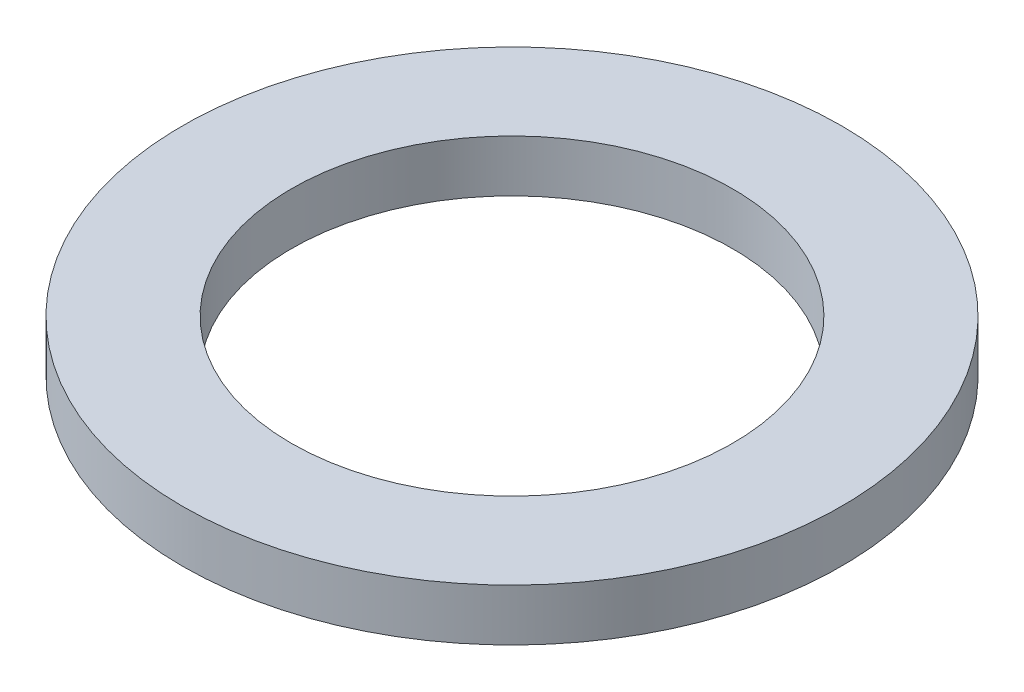
ISO-10303-21;
HEADER;
FILE_DESCRIPTION(('STEP AP214'),'2;1');
FILE_NAME('part.step','',(''),(''),'','','');
FILE_SCHEMA(('AUTOMOTIVE_DESIGN { 1 0 10303 214 1 1 1 1 }'));
ENDSEC;
DATA;
#1=APPLICATION_CONTEXT('core data for automotive mechanical design processes');
#2=APPLICATION_PROTOCOL_DEFINITION('international standard','automotive_design',2000,#1);
#3=PRODUCT_CONTEXT('',#1,'mechanical');
#4=PRODUCT('Part','Part','',(#3));
#5=PRODUCT_RELATED_PRODUCT_CATEGORY('part','',(#4));
#6=PRODUCT_DEFINITION_FORMATION('','',#4);
#7=PRODUCT_DEFINITION_CONTEXT('part definition',#1,'design');
#8=PRODUCT_DEFINITION('design','',#6,#7);
#9=PRODUCT_DEFINITION_SHAPE('','',#8);
#10=(LENGTH_UNIT() NAMED_UNIT(*) SI_UNIT(.MILLI.,.METRE.));
#11=(NAMED_UNIT(*) PLANE_ANGLE_UNIT() SI_UNIT($,.RADIAN.));
#12=(NAMED_UNIT(*) SI_UNIT($,.STERADIAN.) SOLID_ANGLE_UNIT());
#13=UNCERTAINTY_MEASURE_WITH_UNIT(LENGTH_MEASURE(1.E-05),#10,'distance_accuracy_value','');
#14=(GEOMETRIC_REPRESENTATION_CONTEXT(3) GLOBAL_UNCERTAINTY_ASSIGNED_CONTEXT((#13)) GLOBAL_UNIT_ASSIGNED_CONTEXT((#10,
#11,#12)) REPRESENTATION_CONTEXT('',''));
#15=CARTESIAN_POINT('',(0.,0.,0.));
#16=DIRECTION('',(0.,0.,1.));
#17=DIRECTION('',(1.,0.,0.));
#18=AXIS2_PLACEMENT_3D('',#15,#16,#17);
#19=CARTESIAN_POINT('',(0.,2.,0.));
#20=DIRECTION('',(0.,1.,0.));
#21=DIRECTION('',(0.,0.,1.));
#22=AXIS2_PLACEMENT_3D('',#19,#20,#21);
#23=PLANE('',#22);
#24=CARTESIAN_POINT('',(0.,2.,0.));
#25=DIRECTION('',(0.,1.,0.));
#26=DIRECTION('',(0.,0.,1.));
#27=AXIS2_PLACEMENT_3D('',#24,#25,#26);
#28=CIRCLE('',#27,12.7);
#29=CARTESIAN_POINT('',(0.,2.,12.7));
#30=VERTEX_POINT('',#29);
#31=EDGE_CURVE('E10',#30,#30,#28,.T.);
#32=ORIENTED_EDGE('',*,*,#31,.T.);
#33=EDGE_LOOP('',(#32));
#34=FACE_BOUND('',#33,.T.);
#35=CARTESIAN_POINT('',(0.,2.,0.));
#36=DIRECTION('',(0.,1.,0.));
#37=DIRECTION('',(0.,0.,1.));
#38=AXIS2_PLACEMENT_3D('',#35,#36,#37);
#39=CIRCLE('',#38,8.5);
#40=CARTESIAN_POINT('',(0.,2.,8.5));
#41=VERTEX_POINT('',#40);
#42=EDGE_CURVE('E50',#41,#41,#39,.T.);
#43=ORIENTED_EDGE('',*,*,#42,.F.);
#44=EDGE_LOOP('',(#43));
#45=FACE_BOUND('',#44,.T.);
#46=ADVANCED_FACE('F37',(#34,#45),#23,.T.);
#47=CARTESIAN_POINT('',(0.,0.,0.));
#48=DIRECTION('',(0.,1.,0.));
#49=DIRECTION('',(0.,0.,1.));
#50=AXIS2_PLACEMENT_3D('',#47,#48,#49);
#51=PLANE('',#50);
#52=CARTESIAN_POINT('',(0.,0.,0.));
#53=DIRECTION('',(0.,1.,0.));
#54=DIRECTION('',(0.,0.,1.));
#55=AXIS2_PLACEMENT_3D('',#52,#53,#54);
#56=CIRCLE('',#55,12.7);
#57=CARTESIAN_POINT('',(0.,0.,12.7));
#58=VERTEX_POINT('',#57);
#59=EDGE_CURVE('E41',#58,#58,#56,.T.);
#60=ORIENTED_EDGE('',*,*,#59,.F.);
#61=EDGE_LOOP('',(#60));
#62=FACE_BOUND('',#61,.T.);
#63=CARTESIAN_POINT('',(0.,0.,0.));
#64=DIRECTION('',(0.,1.,0.));
#65=DIRECTION('',(0.,0.,1.));
#66=AXIS2_PLACEMENT_3D('',#63,#64,#65);
#67=CIRCLE('',#66,8.5);
#68=CARTESIAN_POINT('',(0.,0.,8.5));
#69=VERTEX_POINT('',#68);
#70=EDGE_CURVE('E52',#69,#69,#67,.T.);
#71=ORIENTED_EDGE('',*,*,#70,.T.);
#72=EDGE_LOOP('',(#71));
#73=FACE_BOUND('',#72,.T.);
#74=ADVANCED_FACE('F64',(#62,#73),#51,.F.);
#75=CARTESIAN_POINT('',(0.,2.,0.));
#76=DIRECTION('',(0.,-1.,0.));
#77=DIRECTION('',(0.,0.,-1.));
#78=AXIS2_PLACEMENT_3D('',#75,#76,#77);
#79=CYLINDRICAL_SURFACE('',#78,12.7);
#80=ORIENTED_EDGE('',*,*,#31,.F.);
#81=EDGE_LOOP('',(#80));
#82=FACE_BOUND('',#81,.T.);
#83=ORIENTED_EDGE('',*,*,#59,.T.);
#84=EDGE_LOOP('',(#83));
#85=FACE_BOUND('',#84,.T.);
#86=ADVANCED_FACE('F39',(#82,#85),#79,.T.);
#87=CARTESIAN_POINT('',(0.,2.,0.));
#88=DIRECTION('',(0.,-1.,0.));
#89=DIRECTION('',(0.,0.,-1.));
#90=AXIS2_PLACEMENT_3D('',#87,#88,#89);
#91=CYLINDRICAL_SURFACE('',#90,8.5);
#92=ORIENTED_EDGE('',*,*,#42,.T.);
#93=EDGE_LOOP('',(#92));
#94=FACE_BOUND('',#93,.T.);
#95=ORIENTED_EDGE('',*,*,#70,.F.);
#96=EDGE_LOOP('',(#95));
#97=FACE_BOUND('',#96,.T.);
#98=ADVANCED_FACE('F60',(#94,#97),#91,.F.);
#99=CLOSED_SHELL('',(#46,#74,#86,#98));
#100=MANIFOLD_SOLID_BREP('B2',#99);
#101=ADVANCED_BREP_SHAPE_REPRESENTATION('',(#18,#100),#14);
#102=SHAPE_DEFINITION_REPRESENTATION(#9,#101);
ENDSEC;
END-ISO-10303-21;
